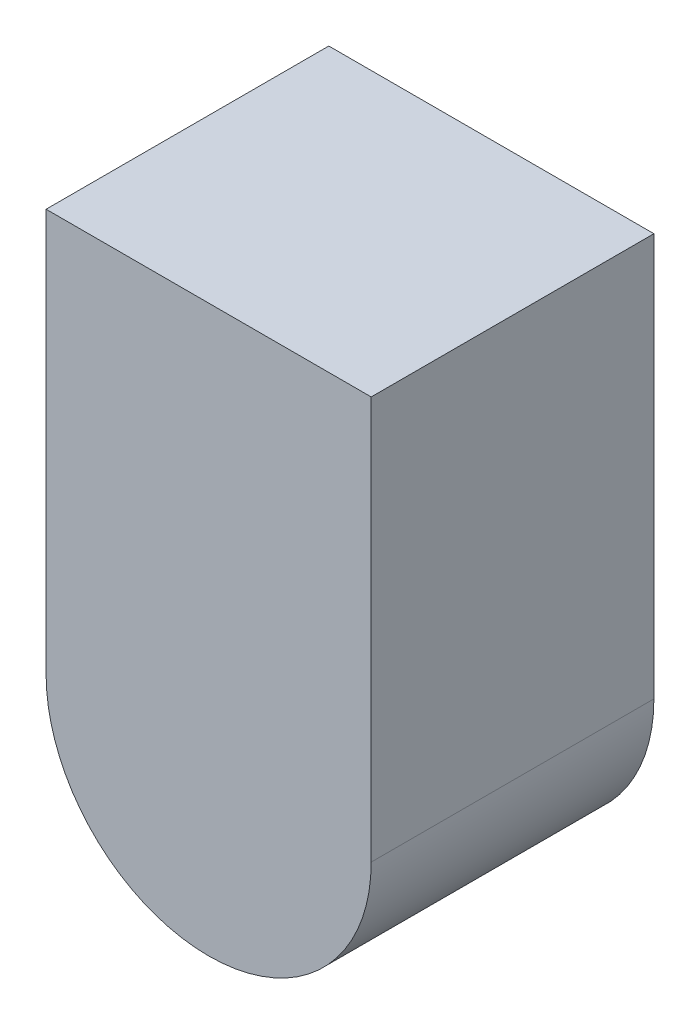
ISO-10303-21;
HEADER;
FILE_DESCRIPTION(('STEP AP214'),'2;1');
FILE_NAME('part.step','',(''),(''),'','','');
FILE_SCHEMA(('AUTOMOTIVE_DESIGN { 1 0 10303 214 1 1 1 1 }'));
ENDSEC;
DATA;
#1=APPLICATION_CONTEXT('core data for automotive mechanical design processes');
#2=APPLICATION_PROTOCOL_DEFINITION('international standard','automotive_design',2000,#1);
#3=PRODUCT_CONTEXT('',#1,'mechanical');
#4=PRODUCT('Part','Part','',(#3));
#5=PRODUCT_RELATED_PRODUCT_CATEGORY('part','',(#4));
#6=PRODUCT_DEFINITION_FORMATION('','',#4);
#7=PRODUCT_DEFINITION_CONTEXT('part definition',#1,'design');
#8=PRODUCT_DEFINITION('design','',#6,#7);
#9=PRODUCT_DEFINITION_SHAPE('','',#8);
#10=(LENGTH_UNIT() NAMED_UNIT(*) SI_UNIT(.MILLI.,.METRE.));
#11=(NAMED_UNIT(*) PLANE_ANGLE_UNIT() SI_UNIT($,.RADIAN.));
#12=(NAMED_UNIT(*) SI_UNIT($,.STERADIAN.) SOLID_ANGLE_UNIT());
#13=UNCERTAINTY_MEASURE_WITH_UNIT(LENGTH_MEASURE(1.E-05),#10,'distance_accuracy_value','');
#14=(GEOMETRIC_REPRESENTATION_CONTEXT(3) GLOBAL_UNCERTAINTY_ASSIGNED_CONTEXT((#13)) GLOBAL_UNIT_ASSIGNED_CONTEXT((#10,
#11,#12)) REPRESENTATION_CONTEXT('',''));
#15=CARTESIAN_POINT('',(0.,0.,0.));
#16=DIRECTION('',(0.,0.,1.));
#17=DIRECTION('',(1.,0.,0.));
#18=AXIS2_PLACEMENT_3D('',#15,#16,#17);
#19=CARTESIAN_POINT('',(1.25,2.8335265642716,0.));
#20=DIRECTION('',(0.,0.,1.));
#21=DIRECTION('',(0.,-1.,0.));
#22=AXIS2_PLACEMENT_3D('',#19,#20,#21);
#23=PLANE('',#22);
#24=DIRECTION('',(-1.,0.,0.));
#25=VECTOR('',#24,1.);
#26=CARTESIAN_POINT('',(1.365,3.,0.));
#27=LINE('',#26,#25);
#28=CARTESIAN_POINT('',(1.365,3.,0.));
#29=VERTEX_POINT('',#28);
#30=CARTESIAN_POINT('',(1.135,3.,0.));
#31=VERTEX_POINT('',#30);
#32=EDGE_CURVE('E11',#29,#31,#27,.T.);
#33=ORIENTED_EDGE('',*,*,#32,.F.);
#34=DIRECTION('',(0.,1.,0.));
#35=VECTOR('',#34,1.);
#36=CARTESIAN_POINT('',(1.365,2.715,0.));
#37=LINE('',#36,#35);
#38=CARTESIAN_POINT('',(1.365,2.715,0.));
#39=VERTEX_POINT('',#38);
#40=EDGE_CURVE('E24',#39,#29,#37,.T.);
#41=ORIENTED_EDGE('',*,*,#40,.F.);
#42=CARTESIAN_POINT('',(1.25,2.715,0.));
#43=DIRECTION('',(0.,0.,1.));
#44=DIRECTION('',(-1.,0.,0.));
#45=AXIS2_PLACEMENT_3D('',#42,#43,#44);
#46=CIRCLE('',#45,0.115);
#47=CARTESIAN_POINT('',(1.135,2.715,0.));
#48=VERTEX_POINT('',#47);
#49=EDGE_CURVE('E85',#48,#39,#46,.T.);
#50=ORIENTED_EDGE('',*,*,#49,.F.);
#51=DIRECTION('',(0.,-1.,0.));
#52=VECTOR('',#51,1.);
#53=CARTESIAN_POINT('',(1.135,3.,0.));
#54=LINE('',#53,#52);
#55=EDGE_CURVE('E82',#31,#48,#54,.T.);
#56=ORIENTED_EDGE('',*,*,#55,.F.);
#57=EDGE_LOOP('',(#33,#41,#50,#56));
#58=FACE_BOUND('',#57,.T.);
#59=ADVANCED_FACE('F17',(#58),#23,.F.);
#60=CARTESIAN_POINT('',(1.135,3.,0.));
#61=DIRECTION('',(-1.,0.,0.));
#62=DIRECTION('',(0.,-1.,0.));
#63=AXIS2_PLACEMENT_3D('',#60,#61,#62);
#64=PLANE('',#63);
#65=ORIENTED_EDGE('',*,*,#55,.T.);
#66=DIRECTION('',(0.,0.,1.));
#67=VECTOR('',#66,1.);
#68=CARTESIAN_POINT('',(1.135,2.715,0.));
#69=LINE('',#68,#67);
#70=CARTESIAN_POINT('',(1.135,2.715,0.2));
#71=VERTEX_POINT('',#70);
#72=EDGE_CURVE('E80',#48,#71,#69,.T.);
#73=ORIENTED_EDGE('',*,*,#72,.T.);
#74=DIRECTION('',(0.,-1.,0.));
#75=VECTOR('',#74,1.);
#76=CARTESIAN_POINT('',(1.135,3.,0.2));
#77=LINE('',#76,#75);
#78=CARTESIAN_POINT('',(1.135,3.,0.2));
#79=VERTEX_POINT('',#78);
#80=EDGE_CURVE('E78',#79,#71,#77,.T.);
#81=ORIENTED_EDGE('',*,*,#80,.F.);
#82=DIRECTION('',(0.,0.,-1.));
#83=VECTOR('',#82,1.);
#84=CARTESIAN_POINT('',(1.135,3.,0.));
#85=LINE('',#84,#83);
#86=EDGE_CURVE('E71',#79,#31,#85,.T.);
#87=ORIENTED_EDGE('',*,*,#86,.T.);
#88=EDGE_LOOP('',(#65,#73,#81,#87));
#89=FACE_BOUND('',#88,.T.);
#90=ADVANCED_FACE('F91',(#89),#64,.T.);
#91=CARTESIAN_POINT('',(1.25,2.715,0.));
#92=DIRECTION('',(0.,0.,1.));
#93=DIRECTION('',(-1.,0.,0.));
#94=AXIS2_PLACEMENT_3D('',#91,#92,#93);
#95=CYLINDRICAL_SURFACE('',#94,0.115);
#96=ORIENTED_EDGE('',*,*,#49,.T.);
#97=DIRECTION('',(0.,0.,1.));
#98=VECTOR('',#97,1.);
#99=CARTESIAN_POINT('',(1.365,2.715,0.));
#100=LINE('',#99,#98);
#101=CARTESIAN_POINT('',(1.365,2.715,0.2));
#102=VERTEX_POINT('',#101);
#103=EDGE_CURVE('E75',#39,#102,#100,.T.);
#104=ORIENTED_EDGE('',*,*,#103,.T.);
#105=CARTESIAN_POINT('',(1.25,2.715,0.2));
#106=DIRECTION('',(0.,0.,1.));
#107=DIRECTION('',(-1.,0.,0.));
#108=AXIS2_PLACEMENT_3D('',#105,#106,#107);
#109=CIRCLE('',#108,0.115);
#110=EDGE_CURVE('E59',#71,#102,#109,.T.);
#111=ORIENTED_EDGE('',*,*,#110,.F.);
#112=ORIENTED_EDGE('',*,*,#72,.F.);
#113=EDGE_LOOP('',(#96,#104,#111,#112));
#114=FACE_BOUND('',#113,.T.);
#115=ADVANCED_FACE('F89',(#114),#95,.T.);
#116=CARTESIAN_POINT('',(1.365,2.715,0.));
#117=DIRECTION('',(1.,0.,0.));
#118=DIRECTION('',(0.,1.,0.));
#119=AXIS2_PLACEMENT_3D('',#116,#117,#118);
#120=PLANE('',#119);
#121=ORIENTED_EDGE('',*,*,#40,.T.);
#122=DIRECTION('',(0.,0.,1.));
#123=VECTOR('',#122,1.);
#124=CARTESIAN_POINT('',(1.365,3.,0.));
#125=LINE('',#124,#123);
#126=CARTESIAN_POINT('',(1.365,3.,0.2));
#127=VERTEX_POINT('',#126);
#128=EDGE_CURVE('E53',#29,#127,#125,.T.);
#129=ORIENTED_EDGE('',*,*,#128,.T.);
#130=DIRECTION('',(0.,1.,0.));
#131=VECTOR('',#130,1.);
#132=CARTESIAN_POINT('',(1.365,2.715,0.2));
#133=LINE('',#132,#131);
#134=EDGE_CURVE('E57',#102,#127,#133,.T.);
#135=ORIENTED_EDGE('',*,*,#134,.F.);
#136=ORIENTED_EDGE('',*,*,#103,.F.);
#137=EDGE_LOOP('',(#121,#129,#135,#136));
#138=FACE_BOUND('',#137,.T.);
#139=ADVANCED_FACE('F55',(#138),#120,.T.);
#140=CARTESIAN_POINT('',(3.,3.,0.));
#141=DIRECTION('',(0.,1.,0.));
#142=DIRECTION('',(-1.,0.,0.));
#143=AXIS2_PLACEMENT_3D('',#140,#141,#142);
#144=PLANE('',#143);
#145=ORIENTED_EDGE('',*,*,#86,.F.);
#146=DIRECTION('',(-1.,0.,0.));
#147=VECTOR('',#146,1.);
#148=CARTESIAN_POINT('',(2.125,3.,0.2));
#149=LINE('',#148,#147);
#150=EDGE_CURVE('E66',#127,#79,#149,.T.);
#151=ORIENTED_EDGE('',*,*,#150,.F.);
#152=ORIENTED_EDGE('',*,*,#128,.F.);
#153=ORIENTED_EDGE('',*,*,#32,.T.);
#154=EDGE_LOOP('',(#145,#151,#152,#153));
#155=FACE_BOUND('',#154,.T.);
#156=ADVANCED_FACE('F69',(#155),#144,.T.);
#157=CARTESIAN_POINT('',(1.25,2.8335240809167,0.2));
#158=DIRECTION('',(0.,0.,1.));
#159=DIRECTION('',(1.,0.,0.));
#160=AXIS2_PLACEMENT_3D('',#157,#158,#159);
#161=PLANE('',#160);
#162=ORIENTED_EDGE('',*,*,#134,.T.);
#163=ORIENTED_EDGE('',*,*,#150,.T.);
#164=ORIENTED_EDGE('',*,*,#80,.T.);
#165=ORIENTED_EDGE('',*,*,#110,.T.);
#166=EDGE_LOOP('',(#162,#163,#164,#165));
#167=FACE_BOUND('',#166,.T.);
#168=ADVANCED_FACE('F64',(#167),#161,.T.);
#169=CLOSED_SHELL('',(#59,#90,#115,#139,#156,#168));
#170=MANIFOLD_SOLID_BREP('B1',#169);
#171=ADVANCED_BREP_SHAPE_REPRESENTATION('',(#18,#170),#14);
#172=SHAPE_DEFINITION_REPRESENTATION(#9,#171);
ENDSEC;
END-ISO-10303-21;
